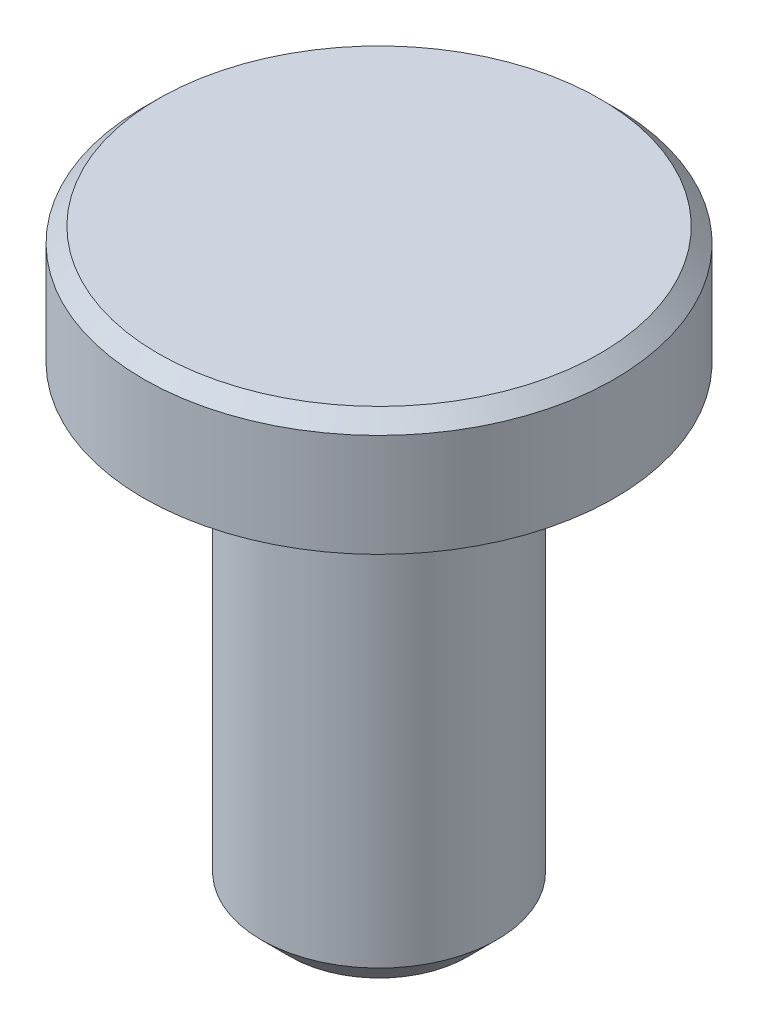
ISO-10303-21;
HEADER;
FILE_DESCRIPTION(('STEP AP214'),'2;1');
FILE_NAME('part.step','',(''),(''),'','','');
FILE_SCHEMA(('AUTOMOTIVE_DESIGN { 1 0 10303 214 1 1 1 1 }'));
ENDSEC;
DATA;
#1=APPLICATION_CONTEXT('core data for automotive mechanical design processes');
#2=APPLICATION_PROTOCOL_DEFINITION('international standard','automotive_design',2000,#1);
#3=PRODUCT_CONTEXT('',#1,'mechanical');
#4=PRODUCT('Part','Part','',(#3));
#5=PRODUCT_RELATED_PRODUCT_CATEGORY('part','',(#4));
#6=PRODUCT_DEFINITION_FORMATION('','',#4);
#7=PRODUCT_DEFINITION_CONTEXT('part definition',#1,'design');
#8=PRODUCT_DEFINITION('design','',#6,#7);
#9=PRODUCT_DEFINITION_SHAPE('','',#8);
#10=(LENGTH_UNIT() NAMED_UNIT(*) SI_UNIT(.MILLI.,.METRE.));
#11=(NAMED_UNIT(*) PLANE_ANGLE_UNIT() SI_UNIT($,.RADIAN.));
#12=(NAMED_UNIT(*) SI_UNIT($,.STERADIAN.) SOLID_ANGLE_UNIT());
#13=UNCERTAINTY_MEASURE_WITH_UNIT(LENGTH_MEASURE(1.E-05),#10,'distance_accuracy_value','');
#14=(GEOMETRIC_REPRESENTATION_CONTEXT(3) GLOBAL_UNCERTAINTY_ASSIGNED_CONTEXT((#13)) GLOBAL_UNIT_ASSIGNED_CONTEXT((#10,
#11,#12)) REPRESENTATION_CONTEXT('',''));
#15=CARTESIAN_POINT('',(0.,0.,0.));
#16=DIRECTION('',(0.,0.,1.));
#17=DIRECTION('',(1.,0.,0.));
#18=AXIS2_PLACEMENT_3D('',#15,#16,#17);
#19=CARTESIAN_POINT('',(0.,-16.,0.));
#20=DIRECTION('',(0.,1.,0.));
#21=DIRECTION('',(0.,0.,1.));
#22=AXIS2_PLACEMENT_3D('',#19,#20,#21);
#23=CYLINDRICAL_SURFACE('',#22,4.);
#24=CARTESIAN_POINT('',(0.,-0.300000000000002,0.));
#25=DIRECTION('',(0.,1.,0.));
#26=DIRECTION('',(0.,0.,1.));
#27=AXIS2_PLACEMENT_3D('',#24,#25,#26);
#28=CIRCLE('',#27,4.);
#29=CARTESIAN_POINT('',(0.,-0.300000000000002,4.));
#30=VERTEX_POINT('',#29);
#31=EDGE_CURVE('E10',#30,#30,#28,.F.);
#32=ORIENTED_EDGE('',*,*,#31,.T.);
#33=EDGE_LOOP('',(#32));
#34=FACE_BOUND('',#33,.T.);
#35=CARTESIAN_POINT('',(0.,-15.,0.));
#36=DIRECTION('',(0.,1.,0.));
#37=DIRECTION('',(0.,0.,1.));
#38=AXIS2_PLACEMENT_3D('',#35,#36,#37);
#39=CIRCLE('',#38,4.);
#40=CARTESIAN_POINT('',(0.,-15.,4.));
#41=VERTEX_POINT('',#40);
#42=EDGE_CURVE('E53',#41,#41,#39,.T.);
#43=ORIENTED_EDGE('',*,*,#42,.T.);
#44=EDGE_LOOP('',(#43));
#45=FACE_BOUND('',#44,.T.);
#46=ADVANCED_FACE('F30',(#34,#45),#23,.T.);
#47=CARTESIAN_POINT('',(0.,-16.,0.));
#48=DIRECTION('',(0.,1.,0.));
#49=DIRECTION('',(0.,0.,1.));
#50=AXIS2_PLACEMENT_3D('',#47,#48,#49);
#51=PLANE('',#50);
#52=CARTESIAN_POINT('',(0.,-16.,0.));
#53=DIRECTION('',(0.,1.,0.));
#54=DIRECTION('',(0.,0.,1.));
#55=AXIS2_PLACEMENT_3D('',#52,#53,#54);
#56=CIRCLE('',#55,2.99999999999999);
#57=CARTESIAN_POINT('',(0.,-16.,2.99999999999999));
#58=VERTEX_POINT('',#57);
#59=EDGE_CURVE('E50',#58,#58,#56,.F.);
#60=ORIENTED_EDGE('',*,*,#59,.T.);
#61=EDGE_LOOP('',(#60));
#62=FACE_BOUND('',#61,.T.);
#63=ADVANCED_FACE('F78',(#62),#51,.F.);
#64=CARTESIAN_POINT('',(0.,4.,0.));
#65=DIRECTION('',(0.,-1.,0.));
#66=DIRECTION('',(0.,0.,-1.));
#67=AXIS2_PLACEMENT_3D('',#64,#65,#66);
#68=CYLINDRICAL_SURFACE('',#67,8.);
#69=CARTESIAN_POINT('',(0.,3.5,0.));
#70=DIRECTION('',(0.,1.,0.));
#71=DIRECTION('',(0.,0.,1.));
#72=AXIS2_PLACEMENT_3D('',#69,#70,#71);
#73=CIRCLE('',#72,8.);
#74=CARTESIAN_POINT('',(0.,3.5,8.));
#75=VERTEX_POINT('',#74);
#76=EDGE_CURVE('E41',#75,#75,#73,.F.);
#77=ORIENTED_EDGE('',*,*,#76,.T.);
#78=EDGE_LOOP('',(#77));
#79=FACE_BOUND('',#78,.T.);
#80=CARTESIAN_POINT('',(0.,0.,0.));
#81=DIRECTION('',(0.,1.,0.));
#82=DIRECTION('',(0.,0.,1.));
#83=AXIS2_PLACEMENT_3D('',#80,#81,#82);
#84=CIRCLE('',#83,8.);
#85=CARTESIAN_POINT('',(0.,0.,8.));
#86=VERTEX_POINT('',#85);
#87=EDGE_CURVE('E56',#86,#86,#84,.T.);
#88=ORIENTED_EDGE('',*,*,#87,.T.);
#89=EDGE_LOOP('',(#88));
#90=FACE_BOUND('',#89,.T.);
#91=ADVANCED_FACE('F60',(#79,#90),#68,.T.);
#92=CARTESIAN_POINT('',(0.,4.,0.));
#93=DIRECTION('',(0.,1.,0.));
#94=DIRECTION('',(0.,0.,1.));
#95=AXIS2_PLACEMENT_3D('',#92,#93,#94);
#96=PLANE('',#95);
#97=CARTESIAN_POINT('',(0.,4.,0.));
#98=DIRECTION('',(0.,1.,0.));
#99=DIRECTION('',(0.,0.,1.));
#100=AXIS2_PLACEMENT_3D('',#97,#98,#99);
#101=CIRCLE('',#100,7.5);
#102=CARTESIAN_POINT('',(0.,4.,7.5));
#103=VERTEX_POINT('',#102);
#104=EDGE_CURVE('E45',#103,#103,#101,.T.);
#105=ORIENTED_EDGE('',*,*,#104,.T.);
#106=EDGE_LOOP('',(#105));
#107=FACE_BOUND('',#106,.T.);
#108=ADVANCED_FACE('F65',(#107),#96,.T.);
#109=CARTESIAN_POINT('',(0.,0.,0.));
#110=DIRECTION('',(0.,1.,0.));
#111=DIRECTION('',(0.,0.,1.));
#112=AXIS2_PLACEMENT_3D('',#109,#110,#111);
#113=PLANE('',#112);
#114=CARTESIAN_POINT('',(0.,0.,0.));
#115=DIRECTION('',(0.,1.,0.));
#116=DIRECTION('',(0.,0.,1.));
#117=AXIS2_PLACEMENT_3D('',#114,#115,#116);
#118=CIRCLE('',#117,4.3);
#119=CARTESIAN_POINT('',(0.,0.,4.3));
#120=VERTEX_POINT('',#119);
#121=EDGE_CURVE('E37',#120,#120,#118,.T.);
#122=ORIENTED_EDGE('',*,*,#121,.T.);
#123=EDGE_LOOP('',(#122));
#124=FACE_BOUND('',#123,.T.);
#125=ORIENTED_EDGE('',*,*,#87,.F.);
#126=EDGE_LOOP('',(#125));
#127=FACE_BOUND('',#126,.T.);
#128=ADVANCED_FACE('F62',(#124,#127),#113,.F.);
#129=CARTESIAN_POINT('',(0.,-15.,0.));
#130=DIRECTION('',(0.,1.,0.));
#131=DIRECTION('',(0.,0.,1.));
#132=AXIS2_PLACEMENT_3D('',#129,#130,#131);
#133=CONICAL_SURFACE('',#132,4.,0.785398163397452);
#134=ORIENTED_EDGE('',*,*,#59,.F.);
#135=EDGE_LOOP('',(#134));
#136=FACE_BOUND('',#135,.T.);
#137=ORIENTED_EDGE('',*,*,#42,.F.);
#138=EDGE_LOOP('',(#137));
#139=FACE_BOUND('',#138,.T.);
#140=ADVANCED_FACE('F64',(#136,#139),#133,.T.);
#141=CARTESIAN_POINT('',(0.,4.,0.));
#142=DIRECTION('',(0.,-1.,0.));
#143=DIRECTION('',(0.,0.,-1.));
#144=AXIS2_PLACEMENT_3D('',#141,#142,#143);
#145=CONICAL_SURFACE('',#144,7.5,0.785398163397448);
#146=ORIENTED_EDGE('',*,*,#76,.F.);
#147=EDGE_LOOP('',(#146));
#148=FACE_BOUND('',#147,.T.);
#149=ORIENTED_EDGE('',*,*,#104,.F.);
#150=EDGE_LOOP('',(#149));
#151=FACE_BOUND('',#150,.T.);
#152=ADVANCED_FACE('F71',(#148,#151),#145,.T.);
#153=CARTESIAN_POINT('',(0.,-0.300000000000002,0.));
#154=DIRECTION('',(0.,1.,0.));
#155=DIRECTION('',(0.,0.,1.));
#156=AXIS2_PLACEMENT_3D('',#153,#154,#155);
#157=TOROIDAL_SURFACE('',#156,4.3,0.3);
#158=ORIENTED_EDGE('',*,*,#31,.F.);
#159=EDGE_LOOP('',(#158));
#160=FACE_BOUND('',#159,.T.);
#161=ORIENTED_EDGE('',*,*,#121,.F.);
#162=EDGE_LOOP('',(#161));
#163=FACE_BOUND('',#162,.T.);
#164=ADVANCED_FACE('F32',(#160,#163),#157,.F.);
#165=CLOSED_SHELL('',(#46,#63,#91,#108,#128,#140,#152,#164));
#166=MANIFOLD_SOLID_BREP('B2',#165);
#167=ADVANCED_BREP_SHAPE_REPRESENTATION('',(#18,#166),#14);
#168=SHAPE_DEFINITION_REPRESENTATION(#9,#167);
ENDSEC;
END-ISO-10303-21;
